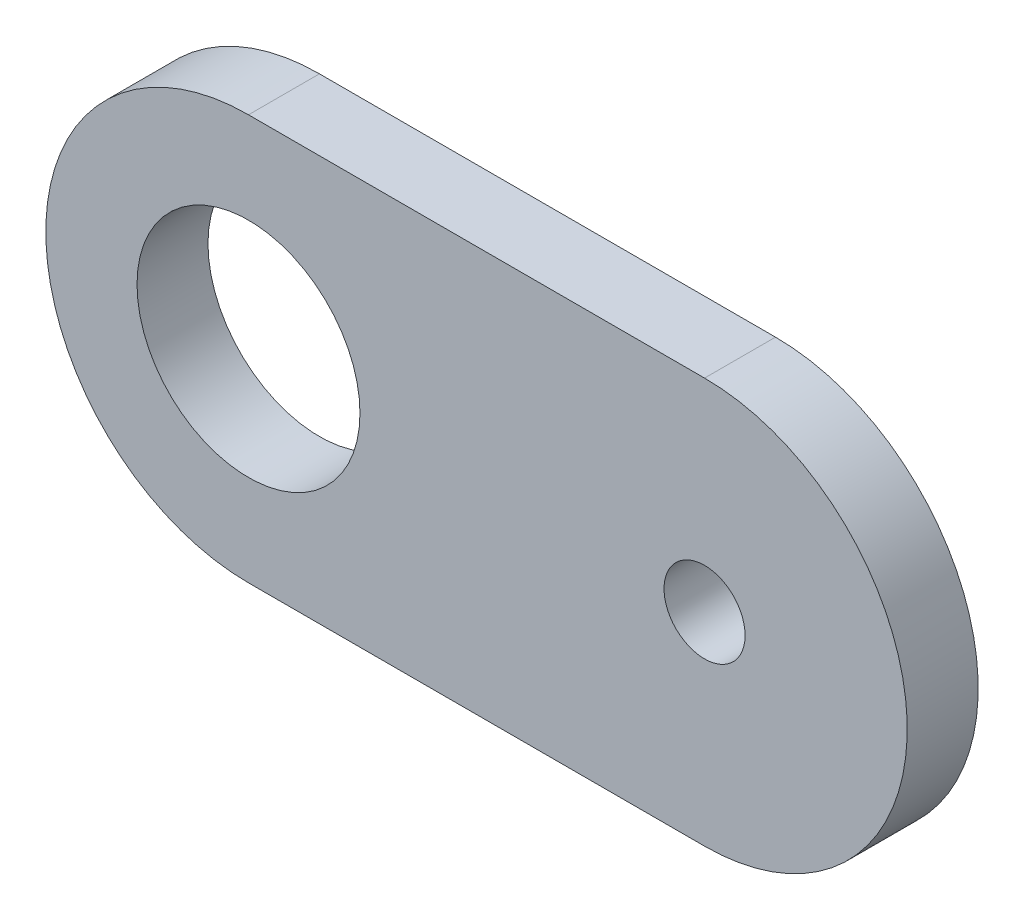
ISO-10303-21;
HEADER;
FILE_DESCRIPTION(('STEP AP214'),'2;1');
FILE_NAME('part.step','',(''),(''),'','','');
FILE_SCHEMA(('AUTOMOTIVE_DESIGN { 1 0 10303 214 1 1 1 1 }'));
ENDSEC;
DATA;
#1=APPLICATION_CONTEXT('core data for automotive mechanical design processes');
#2=APPLICATION_PROTOCOL_DEFINITION('international standard','automotive_design',2000,#1);
#3=PRODUCT_CONTEXT('',#1,'mechanical');
#4=PRODUCT('Part','Part','',(#3));
#5=PRODUCT_RELATED_PRODUCT_CATEGORY('part','',(#4));
#6=PRODUCT_DEFINITION_FORMATION('','',#4);
#7=PRODUCT_DEFINITION_CONTEXT('part definition',#1,'design');
#8=PRODUCT_DEFINITION('design','',#6,#7);
#9=PRODUCT_DEFINITION_SHAPE('','',#8);
#10=(LENGTH_UNIT() NAMED_UNIT(*) SI_UNIT(.MILLI.,.METRE.));
#11=(NAMED_UNIT(*) PLANE_ANGLE_UNIT() SI_UNIT($,.RADIAN.));
#12=(NAMED_UNIT(*) SI_UNIT($,.STERADIAN.) SOLID_ANGLE_UNIT());
#13=UNCERTAINTY_MEASURE_WITH_UNIT(LENGTH_MEASURE(1.E-05),#10,'distance_accuracy_value','');
#14=(GEOMETRIC_REPRESENTATION_CONTEXT(3) GLOBAL_UNCERTAINTY_ASSIGNED_CONTEXT((#13)) GLOBAL_UNIT_ASSIGNED_CONTEXT((#10,
#11,#12)) REPRESENTATION_CONTEXT('',''));
#15=CARTESIAN_POINT('',(0.,0.,0.));
#16=DIRECTION('',(0.,0.,1.));
#17=DIRECTION('',(1.,0.,0.));
#18=AXIS2_PLACEMENT_3D('',#15,#16,#17);
#19=CARTESIAN_POINT('',(0.,20.,7.));
#20=DIRECTION('',(0.,0.,-1.));
#21=DIRECTION('',(-1.,0.,0.));
#22=AXIS2_PLACEMENT_3D('',#19,#20,#21);
#23=CYLINDRICAL_SURFACE('',#22,20.);
#24=CARTESIAN_POINT('',(0.,20.,0.));
#25=DIRECTION('',(0.,0.,1.));
#26=DIRECTION('',(1.,0.,0.));
#27=AXIS2_PLACEMENT_3D('',#24,#25,#26);
#28=CIRCLE('',#27,20.);
#29=CARTESIAN_POINT('',(0.,40.,0.));
#30=VERTEX_POINT('',#29);
#31=CARTESIAN_POINT('',(0.,0.,0.));
#32=VERTEX_POINT('',#31);
#33=EDGE_CURVE('E98',#30,#32,#28,.T.);
#34=ORIENTED_EDGE('',*,*,#33,.T.);
#35=DIRECTION('',(0.,0.,-1.));
#36=VECTOR('',#35,1.);
#37=CARTESIAN_POINT('',(0.,0.,7.));
#38=LINE('',#37,#36);
#39=CARTESIAN_POINT('',(0.,0.,7.));
#40=VERTEX_POINT('',#39);
#41=EDGE_CURVE('E11',#40,#32,#38,.T.);
#42=ORIENTED_EDGE('',*,*,#41,.F.);
#43=CARTESIAN_POINT('',(0.,20.,7.));
#44=DIRECTION('',(0.,0.,1.));
#45=DIRECTION('',(1.,0.,0.));
#46=AXIS2_PLACEMENT_3D('',#43,#44,#45);
#47=CIRCLE('',#46,20.);
#48=CARTESIAN_POINT('',(0.,40.,7.));
#49=VERTEX_POINT('',#48);
#50=EDGE_CURVE('E86',#49,#40,#47,.T.);
#51=ORIENTED_EDGE('',*,*,#50,.F.);
#52=DIRECTION('',(0.,0.,-1.));
#53=VECTOR('',#52,1.);
#54=CARTESIAN_POINT('',(0.,40.,7.));
#55=LINE('',#54,#53);
#56=EDGE_CURVE('E94',#49,#30,#55,.T.);
#57=ORIENTED_EDGE('',*,*,#56,.T.);
#58=EDGE_LOOP('',(#34,#42,#51,#57));
#59=FACE_BOUND('',#58,.T.);
#60=ADVANCED_FACE('F35',(#59),#23,.T.);
#61=CARTESIAN_POINT('',(0.,0.,7.));
#62=DIRECTION('',(0.,1.,0.));
#63=DIRECTION('',(0.,0.,1.));
#64=AXIS2_PLACEMENT_3D('',#61,#62,#63);
#65=PLANE('',#64);
#66=DIRECTION('',(1.,0.,0.));
#67=VECTOR('',#66,1.);
#68=CARTESIAN_POINT('',(0.,0.,0.));
#69=LINE('',#68,#67);
#70=CARTESIAN_POINT('',(45.,0.,0.));
#71=VERTEX_POINT('',#70);
#72=EDGE_CURVE('E90',#32,#71,#69,.T.);
#73=ORIENTED_EDGE('',*,*,#72,.T.);
#74=DIRECTION('',(0.,0.,-1.));
#75=VECTOR('',#74,1.);
#76=CARTESIAN_POINT('',(45.,0.,7.));
#77=LINE('',#76,#75);
#78=CARTESIAN_POINT('',(45.,0.,7.));
#79=VERTEX_POINT('',#78);
#80=EDGE_CURVE('E43',#79,#71,#77,.T.);
#81=ORIENTED_EDGE('',*,*,#80,.F.);
#82=DIRECTION('',(1.,0.,0.));
#83=VECTOR('',#82,1.);
#84=CARTESIAN_POINT('',(0.,0.,7.));
#85=LINE('',#84,#83);
#86=EDGE_CURVE('E81',#40,#79,#85,.T.);
#87=ORIENTED_EDGE('',*,*,#86,.F.);
#88=ORIENTED_EDGE('',*,*,#41,.T.);
#89=EDGE_LOOP('',(#73,#81,#87,#88));
#90=FACE_BOUND('',#89,.T.);
#91=ADVANCED_FACE('F89',(#90),#65,.F.);
#92=CARTESIAN_POINT('',(45.,20.,7.));
#93=DIRECTION('',(0.,0.,-1.));
#94=DIRECTION('',(-1.,0.,0.));
#95=AXIS2_PLACEMENT_3D('',#92,#93,#94);
#96=CYLINDRICAL_SURFACE('',#95,20.);
#97=CARTESIAN_POINT('',(45.,20.,0.));
#98=DIRECTION('',(0.,0.,1.));
#99=DIRECTION('',(1.,0.,0.));
#100=AXIS2_PLACEMENT_3D('',#97,#98,#99);
#101=CIRCLE('',#100,20.);
#102=CARTESIAN_POINT('',(45.,40.,0.));
#103=VERTEX_POINT('',#102);
#104=EDGE_CURVE('E68',#71,#103,#101,.T.);
#105=ORIENTED_EDGE('',*,*,#104,.T.);
#106=DIRECTION('',(0.,0.,-1.));
#107=VECTOR('',#106,1.);
#108=CARTESIAN_POINT('',(45.,40.,7.));
#109=LINE('',#108,#107);
#110=CARTESIAN_POINT('',(45.,40.,7.));
#111=VERTEX_POINT('',#110);
#112=EDGE_CURVE('E91',#111,#103,#109,.T.);
#113=ORIENTED_EDGE('',*,*,#112,.F.);
#114=CARTESIAN_POINT('',(45.,20.,7.));
#115=DIRECTION('',(0.,0.,1.));
#116=DIRECTION('',(1.,0.,0.));
#117=AXIS2_PLACEMENT_3D('',#114,#115,#116);
#118=CIRCLE('',#117,20.);
#119=EDGE_CURVE('E84',#79,#111,#118,.T.);
#120=ORIENTED_EDGE('',*,*,#119,.F.);
#121=ORIENTED_EDGE('',*,*,#80,.T.);
#122=EDGE_LOOP('',(#105,#113,#120,#121));
#123=FACE_BOUND('',#122,.T.);
#124=ADVANCED_FACE('F92',(#123),#96,.T.);
#125=CARTESIAN_POINT('',(0.,40.,7.));
#126=DIRECTION('',(0.,-1.,0.));
#127=DIRECTION('',(1.,0.,0.));
#128=AXIS2_PLACEMENT_3D('',#125,#126,#127);
#129=PLANE('',#128);
#130=DIRECTION('',(-1.,0.,0.));
#131=VECTOR('',#130,1.);
#132=CARTESIAN_POINT('',(0.,40.,0.));
#133=LINE('',#132,#131);
#134=EDGE_CURVE('E74',#103,#30,#133,.T.);
#135=ORIENTED_EDGE('',*,*,#134,.T.);
#136=ORIENTED_EDGE('',*,*,#56,.F.);
#137=DIRECTION('',(-1.,0.,0.));
#138=VECTOR('',#137,1.);
#139=CARTESIAN_POINT('',(0.,40.,7.));
#140=LINE('',#139,#138);
#141=EDGE_CURVE('E51',#111,#49,#140,.T.);
#142=ORIENTED_EDGE('',*,*,#141,.F.);
#143=ORIENTED_EDGE('',*,*,#112,.T.);
#144=EDGE_LOOP('',(#135,#136,#142,#143));
#145=FACE_BOUND('',#144,.T.);
#146=ADVANCED_FACE('F106',(#145),#129,.F.);
#147=CARTESIAN_POINT('',(0.,20.,7.));
#148=DIRECTION('',(0.,0.,1.));
#149=DIRECTION('',(1.,0.,0.));
#150=AXIS2_PLACEMENT_3D('',#147,#148,#149);
#151=PLANE('',#150);
#152=CARTESIAN_POINT('',(45.,20.,7.));
#153=DIRECTION('',(0.,0.,1.));
#154=DIRECTION('',(1.,0.,0.));
#155=AXIS2_PLACEMENT_3D('',#152,#153,#154);
#156=CIRCLE('',#155,4.00000000000001);
#157=CARTESIAN_POINT('',(49.,20.,7.));
#158=VERTEX_POINT('',#157);
#159=EDGE_CURVE('E118',#158,#158,#156,.T.);
#160=ORIENTED_EDGE('',*,*,#159,.F.);
#161=EDGE_LOOP('',(#160));
#162=FACE_BOUND('',#161,.T.);
#163=CARTESIAN_POINT('',(0.,20.,7.));
#164=DIRECTION('',(0.,0.,-1.));
#165=DIRECTION('',(-1.,0.,0.));
#166=AXIS2_PLACEMENT_3D('',#163,#164,#165);
#167=CIRCLE('',#166,11.);
#168=CARTESIAN_POINT('',(-11.,20.,7.));
#169=VERTEX_POINT('',#168);
#170=EDGE_CURVE('E101',#169,#169,#167,.T.);
#171=ORIENTED_EDGE('',*,*,#170,.T.);
#172=EDGE_LOOP('',(#171));
#173=FACE_BOUND('',#172,.T.);
#174=ORIENTED_EDGE('',*,*,#50,.T.);
#175=ORIENTED_EDGE('',*,*,#86,.T.);
#176=ORIENTED_EDGE('',*,*,#119,.T.);
#177=ORIENTED_EDGE('',*,*,#141,.T.);
#178=EDGE_LOOP('',(#174,#175,#176,#177));
#179=FACE_BOUND('',#178,.T.);
#180=ADVANCED_FACE('F82',(#162,#173,#179),#151,.T.);
#181=CARTESIAN_POINT('',(0.,20.,0.));
#182=DIRECTION('',(0.,0.,1.));
#183=DIRECTION('',(1.,0.,0.));
#184=AXIS2_PLACEMENT_3D('',#181,#182,#183);
#185=PLANE('',#184);
#186=CARTESIAN_POINT('',(45.,20.,0.));
#187=DIRECTION('',(0.,0.,1.));
#188=DIRECTION('',(1.,0.,0.));
#189=AXIS2_PLACEMENT_3D('',#186,#187,#188);
#190=CIRCLE('',#189,4.00000000000001);
#191=CARTESIAN_POINT('',(49.,20.,0.));
#192=VERTEX_POINT('',#191);
#193=EDGE_CURVE('E115',#192,#192,#190,.T.);
#194=ORIENTED_EDGE('',*,*,#193,.T.);
#195=EDGE_LOOP('',(#194));
#196=FACE_BOUND('',#195,.T.);
#197=CARTESIAN_POINT('',(0.,20.,0.));
#198=DIRECTION('',(0.,0.,-1.));
#199=DIRECTION('',(-1.,0.,0.));
#200=AXIS2_PLACEMENT_3D('',#197,#198,#199);
#201=CIRCLE('',#200,11.);
#202=CARTESIAN_POINT('',(-11.,20.,0.));
#203=VERTEX_POINT('',#202);
#204=EDGE_CURVE('E112',#203,#203,#201,.T.);
#205=ORIENTED_EDGE('',*,*,#204,.F.);
#206=EDGE_LOOP('',(#205));
#207=FACE_BOUND('',#206,.T.);
#208=ORIENTED_EDGE('',*,*,#33,.F.);
#209=ORIENTED_EDGE('',*,*,#134,.F.);
#210=ORIENTED_EDGE('',*,*,#104,.F.);
#211=ORIENTED_EDGE('',*,*,#72,.F.);
#212=EDGE_LOOP('',(#208,#209,#210,#211));
#213=FACE_BOUND('',#212,.T.);
#214=ADVANCED_FACE('F109',(#196,#207,#213),#185,.F.);
#215=CARTESIAN_POINT('',(0.,20.,7.));
#216=DIRECTION('',(0.,0.,-1.));
#217=DIRECTION('',(-1.,0.,0.));
#218=AXIS2_PLACEMENT_3D('',#215,#216,#217);
#219=CYLINDRICAL_SURFACE('',#218,11.);
#220=ORIENTED_EDGE('',*,*,#170,.F.);
#221=EDGE_LOOP('',(#220));
#222=FACE_BOUND('',#221,.T.);
#223=ORIENTED_EDGE('',*,*,#204,.T.);
#224=EDGE_LOOP('',(#223));
#225=FACE_BOUND('',#224,.T.);
#226=ADVANCED_FACE('F129',(#222,#225),#219,.F.);
#227=CARTESIAN_POINT('',(45.,20.,0.));
#228=DIRECTION('',(0.,0.,1.));
#229=DIRECTION('',(1.,0.,0.));
#230=AXIS2_PLACEMENT_3D('',#227,#228,#229);
#231=CYLINDRICAL_SURFACE('',#230,4.00000000000001);
#232=ORIENTED_EDGE('',*,*,#193,.F.);
#233=EDGE_LOOP('',(#232));
#234=FACE_BOUND('',#233,.T.);
#235=ORIENTED_EDGE('',*,*,#159,.T.);
#236=EDGE_LOOP('',(#235));
#237=FACE_BOUND('',#236,.T.);
#238=ADVANCED_FACE('F126',(#234,#237),#231,.F.);
#239=CLOSED_SHELL('',(#60,#91,#124,#146,#180,#214,#226,#238));
#240=MANIFOLD_SOLID_BREP('B2',#239);
#241=ADVANCED_BREP_SHAPE_REPRESENTATION('',(#18,#240),#14);
#242=SHAPE_DEFINITION_REPRESENTATION(#9,#241);
ENDSEC;
END-ISO-10303-21;
